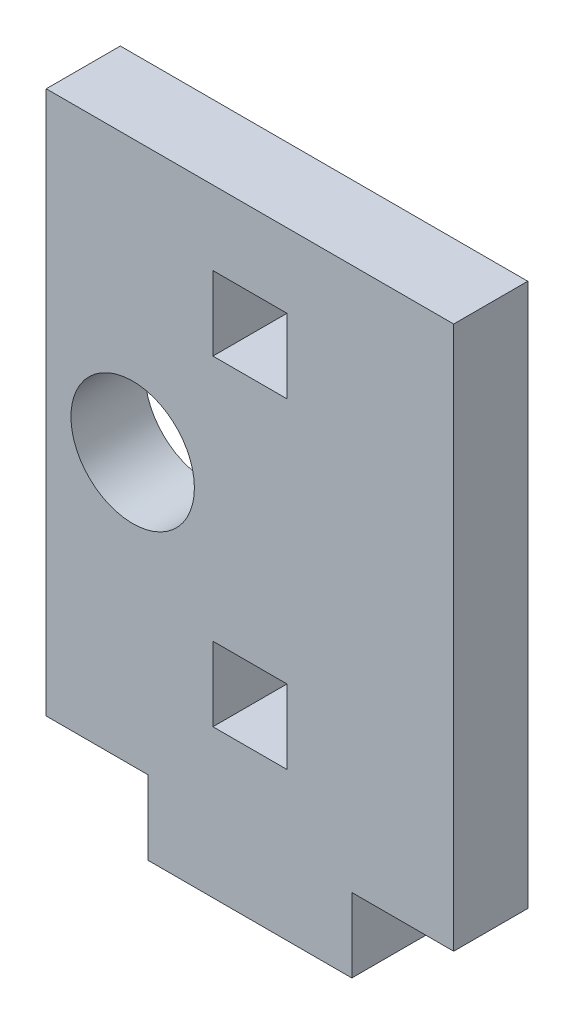
ISO-10303-21;
HEADER;
FILE_DESCRIPTION(('STEP AP214'),'2;1');
FILE_NAME('part.step','',(''),(''),'','','');
FILE_SCHEMA(('AUTOMOTIVE_DESIGN { 1 0 10303 214 1 1 1 1 }'));
ENDSEC;
DATA;
#1=APPLICATION_CONTEXT('core data for automotive mechanical design processes');
#2=APPLICATION_PROTOCOL_DEFINITION('international standard','automotive_design',2000,#1);
#3=PRODUCT_CONTEXT('',#1,'mechanical');
#4=PRODUCT('Part','Part','',(#3));
#5=PRODUCT_RELATED_PRODUCT_CATEGORY('part','',(#4));
#6=PRODUCT_DEFINITION_FORMATION('','',#4);
#7=PRODUCT_DEFINITION_CONTEXT('part definition',#1,'design');
#8=PRODUCT_DEFINITION('design','',#6,#7);
#9=PRODUCT_DEFINITION_SHAPE('','',#8);
#10=(LENGTH_UNIT() NAMED_UNIT(*) SI_UNIT(.MILLI.,.METRE.));
#11=(NAMED_UNIT(*) PLANE_ANGLE_UNIT() SI_UNIT($,.RADIAN.));
#12=(NAMED_UNIT(*) SI_UNIT($,.STERADIAN.) SOLID_ANGLE_UNIT());
#13=UNCERTAINTY_MEASURE_WITH_UNIT(LENGTH_MEASURE(1.E-05),#10,'distance_accuracy_value','');
#14=(GEOMETRIC_REPRESENTATION_CONTEXT(3) GLOBAL_UNCERTAINTY_ASSIGNED_CONTEXT((#13)) GLOBAL_UNIT_ASSIGNED_CONTEXT((#10,
#11,#12)) REPRESENTATION_CONTEXT('',''));
#15=CARTESIAN_POINT('',(0.,0.,0.));
#16=DIRECTION('',(0.,0.,1.));
#17=DIRECTION('',(1.,0.,0.));
#18=AXIS2_PLACEMENT_3D('',#15,#16,#17);
#19=CARTESIAN_POINT('',(-8.25,-11.,3.));
#20=DIRECTION('',(0.,1.,0.));
#21=DIRECTION('',(0.,0.,1.));
#22=AXIS2_PLACEMENT_3D('',#19,#20,#21);
#23=PLANE('',#22);
#24=DIRECTION('',(0.,0.,-1.));
#25=VECTOR('',#24,1.);
#26=CARTESIAN_POINT('',(-4.125,-11.,3.));
#27=LINE('',#26,#25);
#28=CARTESIAN_POINT('',(-4.125,-11.,3.));
#29=VERTEX_POINT('',#28);
#30=CARTESIAN_POINT('',(-4.125,-11.,0.));
#31=VERTEX_POINT('',#30);
#32=EDGE_CURVE('E187',#29,#31,#27,.T.);
#33=ORIENTED_EDGE('',*,*,#32,.F.);
#34=DIRECTION('',(1.,0.,0.));
#35=VECTOR('',#34,1.);
#36=CARTESIAN_POINT('',(-8.25,-11.,3.));
#37=LINE('',#36,#35);
#38=CARTESIAN_POINT('',(-8.25,-11.,3.));
#39=VERTEX_POINT('',#38);
#40=EDGE_CURVE('E257',#39,#29,#37,.T.);
#41=ORIENTED_EDGE('',*,*,#40,.F.);
#42=DIRECTION('',(0.,0.,-1.));
#43=VECTOR('',#42,1.);
#44=CARTESIAN_POINT('',(-8.25,-11.,3.));
#45=LINE('',#44,#43);
#46=CARTESIAN_POINT('',(-8.25,-11.,0.));
#47=VERTEX_POINT('',#46);
#48=EDGE_CURVE('E271',#39,#47,#45,.T.);
#49=ORIENTED_EDGE('',*,*,#48,.T.);
#50=DIRECTION('',(1.,0.,0.));
#51=VECTOR('',#50,1.);
#52=CARTESIAN_POINT('',(-8.25,-11.,0.));
#53=LINE('',#52,#51);
#54=EDGE_CURVE('E252',#47,#31,#53,.T.);
#55=ORIENTED_EDGE('',*,*,#54,.T.);
#56=EDGE_LOOP('',(#33,#41,#49,#55));
#57=FACE_BOUND('',#56,.T.);
#58=ADVANCED_FACE('F34',(#57),#23,.F.);
#59=DIRECTION('',(0.,0.,1.));
#60=VECTOR('',#59,1.);
#61=CARTESIAN_POINT('',(4.125,-11.,3.));
#62=LINE('',#61,#60);
#63=CARTESIAN_POINT('',(4.125,-11.,0.));
#64=VERTEX_POINT('',#63);
#65=CARTESIAN_POINT('',(4.125,-11.,3.));
#66=VERTEX_POINT('',#65);
#67=EDGE_CURVE('E225',#64,#66,#62,.T.);
#68=ORIENTED_EDGE('',*,*,#67,.F.);
#69=CARTESIAN_POINT('',(8.25,-11.,0.));
#70=VERTEX_POINT('',#69);
#71=EDGE_CURVE('E267',#64,#70,#53,.T.);
#72=ORIENTED_EDGE('',*,*,#71,.T.);
#73=DIRECTION('',(0.,0.,-1.));
#74=VECTOR('',#73,1.);
#75=CARTESIAN_POINT('',(8.25,-11.,3.));
#76=LINE('',#75,#74);
#77=CARTESIAN_POINT('',(8.25,-11.,3.));
#78=VERTEX_POINT('',#77);
#79=EDGE_CURVE('E260',#78,#70,#76,.T.);
#80=ORIENTED_EDGE('',*,*,#79,.F.);
#81=EDGE_CURVE('E256',#66,#78,#37,.T.);
#82=ORIENTED_EDGE('',*,*,#81,.F.);
#83=EDGE_LOOP('',(#68,#72,#80,#82));
#84=FACE_BOUND('',#83,.T.);
#85=ADVANCED_FACE('F304',(#84),#23,.F.);
#86=CARTESIAN_POINT('',(8.25,11.,3.));
#87=DIRECTION('',(-1.,0.,0.));
#88=DIRECTION('',(0.,-1.,0.));
#89=AXIS2_PLACEMENT_3D('',#86,#87,#88);
#90=PLANE('',#89);
#91=DIRECTION('',(0.,1.,0.));
#92=VECTOR('',#91,1.);
#93=CARTESIAN_POINT('',(8.25,11.,0.));
#94=LINE('',#93,#92);
#95=CARTESIAN_POINT('',(8.25,11.,0.));
#96=VERTEX_POINT('',#95);
#97=EDGE_CURVE('E247',#70,#96,#94,.T.);
#98=ORIENTED_EDGE('',*,*,#97,.T.);
#99=DIRECTION('',(0.,0.,-1.));
#100=VECTOR('',#99,1.);
#101=CARTESIAN_POINT('',(8.25,11.,3.));
#102=LINE('',#101,#100);
#103=CARTESIAN_POINT('',(8.25,11.,3.));
#104=VERTEX_POINT('',#103);
#105=EDGE_CURVE('E11',#104,#96,#102,.T.);
#106=ORIENTED_EDGE('',*,*,#105,.F.);
#107=DIRECTION('',(0.,1.,0.));
#108=VECTOR('',#107,1.);
#109=CARTESIAN_POINT('',(8.25,11.,3.));
#110=LINE('',#109,#108);
#111=EDGE_CURVE('E248',#78,#104,#110,.T.);
#112=ORIENTED_EDGE('',*,*,#111,.F.);
#113=ORIENTED_EDGE('',*,*,#79,.T.);
#114=EDGE_LOOP('',(#98,#106,#112,#113));
#115=FACE_BOUND('',#114,.T.);
#116=ADVANCED_FACE('F36',(#115),#90,.F.);
#117=CARTESIAN_POINT('',(-8.25,11.,3.));
#118=DIRECTION('',(0.,-1.,0.));
#119=DIRECTION('',(0.,0.,-1.));
#120=AXIS2_PLACEMENT_3D('',#117,#118,#119);
#121=PLANE('',#120);
#122=DIRECTION('',(-1.,0.,0.));
#123=VECTOR('',#122,1.);
#124=CARTESIAN_POINT('',(-8.25,11.,0.));
#125=LINE('',#124,#123);
#126=CARTESIAN_POINT('',(-8.25,11.,0.));
#127=VERTEX_POINT('',#126);
#128=EDGE_CURVE('E263',#96,#127,#125,.T.);
#129=ORIENTED_EDGE('',*,*,#128,.T.);
#130=DIRECTION('',(0.,0.,-1.));
#131=VECTOR('',#130,1.);
#132=CARTESIAN_POINT('',(-8.25,11.,3.));
#133=LINE('',#132,#131);
#134=CARTESIAN_POINT('',(-8.25,11.,3.));
#135=VERTEX_POINT('',#134);
#136=EDGE_CURVE('E42',#135,#127,#133,.T.);
#137=ORIENTED_EDGE('',*,*,#136,.F.);
#138=DIRECTION('',(-1.,0.,0.));
#139=VECTOR('',#138,1.);
#140=CARTESIAN_POINT('',(-8.25,11.,3.));
#141=LINE('',#140,#139);
#142=EDGE_CURVE('E251',#104,#135,#141,.T.);
#143=ORIENTED_EDGE('',*,*,#142,.F.);
#144=ORIENTED_EDGE('',*,*,#105,.T.);
#145=EDGE_LOOP('',(#129,#137,#143,#144));
#146=FACE_BOUND('',#145,.T.);
#147=ADVANCED_FACE('F308',(#146),#121,.F.);
#148=CARTESIAN_POINT('',(-8.25,11.,3.));
#149=DIRECTION('',(1.,0.,0.));
#150=DIRECTION('',(0.,1.,0.));
#151=AXIS2_PLACEMENT_3D('',#148,#149,#150);
#152=PLANE('',#151);
#153=DIRECTION('',(0.,-1.,0.));
#154=VECTOR('',#153,1.);
#155=CARTESIAN_POINT('',(-8.25,11.,0.));
#156=LINE('',#155,#154);
#157=EDGE_CURVE('E265',#127,#47,#156,.T.);
#158=ORIENTED_EDGE('',*,*,#157,.T.);
#159=ORIENTED_EDGE('',*,*,#48,.F.);
#160=DIRECTION('',(0.,-1.,0.));
#161=VECTOR('',#160,1.);
#162=CARTESIAN_POINT('',(-8.25,11.,3.));
#163=LINE('',#162,#161);
#164=EDGE_CURVE('E254',#135,#39,#163,.T.);
#165=ORIENTED_EDGE('',*,*,#164,.F.);
#166=ORIENTED_EDGE('',*,*,#136,.T.);
#167=EDGE_LOOP('',(#158,#159,#165,#166));
#168=FACE_BOUND('',#167,.T.);
#169=ADVANCED_FACE('F278',(#168),#152,.F.);
#170=CARTESIAN_POINT('',(0.,0.,3.));
#171=DIRECTION('',(0.,0.,1.));
#172=DIRECTION('',(1.,0.,0.));
#173=AXIS2_PLACEMENT_3D('',#170,#171,#172);
#174=PLANE('',#173);
#175=CARTESIAN_POINT('',(-4.75,0.,3.));
#176=DIRECTION('',(0.,0.,1.));
#177=DIRECTION('',(1.,0.,0.));
#178=AXIS2_PLACEMENT_3D('',#175,#176,#177);
#179=CIRCLE('',#178,2.5);
#180=CARTESIAN_POINT('',(-2.25,0.,3.));
#181=VERTEX_POINT('',#180);
#182=EDGE_CURVE('E174',#181,#181,#179,.T.);
#183=ORIENTED_EDGE('',*,*,#182,.F.);
#184=EDGE_LOOP('',(#183));
#185=FACE_BOUND('',#184,.T.);
#186=DIRECTION('',(0.,1.,0.));
#187=VECTOR('',#186,1.);
#188=CARTESIAN_POINT('',(1.5,8.,3.));
#189=LINE('',#188,#187);
#190=CARTESIAN_POINT('',(1.5,5.,3.));
#191=VERTEX_POINT('',#190);
#192=CARTESIAN_POINT('',(1.5,8.,3.));
#193=VERTEX_POINT('',#192);
#194=EDGE_CURVE('E49',#191,#193,#189,.T.);
#195=ORIENTED_EDGE('',*,*,#194,.F.);
#196=DIRECTION('',(1.,0.,0.));
#197=VECTOR('',#196,1.);
#198=CARTESIAN_POINT('',(-1.5,5.,3.));
#199=LINE('',#198,#197);
#200=CARTESIAN_POINT('',(-1.5,5.,3.));
#201=VERTEX_POINT('',#200);
#202=EDGE_CURVE('E168',#201,#191,#199,.T.);
#203=ORIENTED_EDGE('',*,*,#202,.F.);
#204=DIRECTION('',(0.,-1.,0.));
#205=VECTOR('',#204,1.);
#206=CARTESIAN_POINT('',(-1.5,8.,3.));
#207=LINE('',#206,#205);
#208=CARTESIAN_POINT('',(-1.5,8.,3.));
#209=VERTEX_POINT('',#208);
#210=EDGE_CURVE('E171',#209,#201,#207,.T.);
#211=ORIENTED_EDGE('',*,*,#210,.F.);
#212=DIRECTION('',(-1.,0.,0.));
#213=VECTOR('',#212,1.);
#214=CARTESIAN_POINT('',(-1.5,8.,3.));
#215=LINE('',#214,#213);
#216=EDGE_CURVE('E180',#193,#209,#215,.T.);
#217=ORIENTED_EDGE('',*,*,#216,.F.);
#218=EDGE_LOOP('',(#195,#203,#211,#217));
#219=FACE_BOUND('',#218,.T.);
#220=DIRECTION('',(0.,1.,0.));
#221=VECTOR('',#220,1.);
#222=CARTESIAN_POINT('',(1.5,-5.,3.));
#223=LINE('',#222,#221);
#224=CARTESIAN_POINT('',(1.5,-8.,3.));
#225=VERTEX_POINT('',#224);
#226=CARTESIAN_POINT('',(1.5,-5.,3.));
#227=VERTEX_POINT('',#226);
#228=EDGE_CURVE('E57',#225,#227,#223,.T.);
#229=ORIENTED_EDGE('',*,*,#228,.F.);
#230=DIRECTION('',(1.,0.,0.));
#231=VECTOR('',#230,1.);
#232=CARTESIAN_POINT('',(-1.5,-8.,3.));
#233=LINE('',#232,#231);
#234=CARTESIAN_POINT('',(-1.5,-8.,3.));
#235=VERTEX_POINT('',#234);
#236=EDGE_CURVE('E195',#235,#225,#233,.T.);
#237=ORIENTED_EDGE('',*,*,#236,.F.);
#238=DIRECTION('',(0.,-1.,0.));
#239=VECTOR('',#238,1.);
#240=CARTESIAN_POINT('',(-1.5,-5.,3.));
#241=LINE('',#240,#239);
#242=CARTESIAN_POINT('',(-1.5,-5.,3.));
#243=VERTEX_POINT('',#242);
#244=EDGE_CURVE('E210',#243,#235,#241,.T.);
#245=ORIENTED_EDGE('',*,*,#244,.F.);
#246=DIRECTION('',(-1.,0.,0.));
#247=VECTOR('',#246,1.);
#248=CARTESIAN_POINT('',(-1.5,-5.,3.));
#249=LINE('',#248,#247);
#250=EDGE_CURVE('E206',#227,#243,#249,.T.);
#251=ORIENTED_EDGE('',*,*,#250,.F.);
#252=EDGE_LOOP('',(#229,#237,#245,#251));
#253=FACE_BOUND('',#252,.T.);
#254=ORIENTED_EDGE('',*,*,#111,.T.);
#255=ORIENTED_EDGE('',*,*,#142,.T.);
#256=ORIENTED_EDGE('',*,*,#164,.T.);
#257=ORIENTED_EDGE('',*,*,#40,.T.);
#258=DIRECTION('',(0.,1.,0.));
#259=VECTOR('',#258,1.);
#260=CARTESIAN_POINT('',(-4.125,-14.,3.));
#261=LINE('',#260,#259);
#262=CARTESIAN_POINT('',(-4.125,-14.,3.));
#263=VERTEX_POINT('',#262);
#264=EDGE_CURVE('E231',#263,#29,#261,.T.);
#265=ORIENTED_EDGE('',*,*,#264,.F.);
#266=DIRECTION('',(-1.,0.,0.));
#267=VECTOR('',#266,1.);
#268=CARTESIAN_POINT('',(-4.125,-14.,3.));
#269=LINE('',#268,#267);
#270=CARTESIAN_POINT('',(4.125,-14.,3.));
#271=VERTEX_POINT('',#270);
#272=EDGE_CURVE('E229',#271,#263,#269,.T.);
#273=ORIENTED_EDGE('',*,*,#272,.F.);
#274=DIRECTION('',(0.,1.,0.));
#275=VECTOR('',#274,1.);
#276=CARTESIAN_POINT('',(4.125,-14.,3.));
#277=LINE('',#276,#275);
#278=EDGE_CURVE('E238',#271,#66,#277,.T.);
#279=ORIENTED_EDGE('',*,*,#278,.T.);
#280=ORIENTED_EDGE('',*,*,#81,.T.);
#281=EDGE_LOOP('',(#254,#255,#256,#257,#265,#273,#279,#280));
#282=FACE_BOUND('',#281,.T.);
#283=ADVANCED_FACE('F289',(#185,#219,#253,#282),#174,.T.);
#284=CARTESIAN_POINT('',(0.,0.,0.));
#285=DIRECTION('',(0.,0.,1.));
#286=DIRECTION('',(1.,0.,0.));
#287=AXIS2_PLACEMENT_3D('',#284,#285,#286);
#288=PLANE('',#287);
#289=CARTESIAN_POINT('',(-4.75,0.,0.));
#290=DIRECTION('',(0.,0.,1.));
#291=DIRECTION('',(1.,0.,0.));
#292=AXIS2_PLACEMENT_3D('',#289,#290,#291);
#293=CIRCLE('',#292,2.5);
#294=CARTESIAN_POINT('',(-2.25,0.,0.));
#295=VERTEX_POINT('',#294);
#296=EDGE_CURVE('E207',#295,#295,#293,.T.);
#297=ORIENTED_EDGE('',*,*,#296,.T.);
#298=EDGE_LOOP('',(#297));
#299=FACE_BOUND('',#298,.T.);
#300=DIRECTION('',(1.,0.,0.));
#301=VECTOR('',#300,1.);
#302=CARTESIAN_POINT('',(-1.5,5.,0.));
#303=LINE('',#302,#301);
#304=CARTESIAN_POINT('',(-1.5,5.,0.));
#305=VERTEX_POINT('',#304);
#306=CARTESIAN_POINT('',(1.5,5.,0.));
#307=VERTEX_POINT('',#306);
#308=EDGE_CURVE('E155',#305,#307,#303,.T.);
#309=ORIENTED_EDGE('',*,*,#308,.T.);
#310=DIRECTION('',(0.,1.,0.));
#311=VECTOR('',#310,1.);
#312=CARTESIAN_POINT('',(1.5,8.,0.));
#313=LINE('',#312,#311);
#314=CARTESIAN_POINT('',(1.5,8.,0.));
#315=VERTEX_POINT('',#314);
#316=EDGE_CURVE('E149',#307,#315,#313,.T.);
#317=ORIENTED_EDGE('',*,*,#316,.T.);
#318=DIRECTION('',(-1.,0.,0.));
#319=VECTOR('',#318,1.);
#320=CARTESIAN_POINT('',(-1.5,8.,0.));
#321=LINE('',#320,#319);
#322=CARTESIAN_POINT('',(-1.5,8.,0.));
#323=VERTEX_POINT('',#322);
#324=EDGE_CURVE('E159',#315,#323,#321,.T.);
#325=ORIENTED_EDGE('',*,*,#324,.T.);
#326=DIRECTION('',(0.,-1.,0.));
#327=VECTOR('',#326,1.);
#328=CARTESIAN_POINT('',(-1.5,8.,0.));
#329=LINE('',#328,#327);
#330=EDGE_CURVE('E163',#323,#305,#329,.T.);
#331=ORIENTED_EDGE('',*,*,#330,.T.);
#332=EDGE_LOOP('',(#309,#317,#325,#331));
#333=FACE_BOUND('',#332,.T.);
#334=DIRECTION('',(1.,0.,0.));
#335=VECTOR('',#334,1.);
#336=CARTESIAN_POINT('',(-1.5,-8.,0.));
#337=LINE('',#336,#335);
#338=CARTESIAN_POINT('',(-1.5,-8.,0.));
#339=VERTEX_POINT('',#338);
#340=CARTESIAN_POINT('',(1.5,-8.,0.));
#341=VERTEX_POINT('',#340);
#342=EDGE_CURVE('E201',#339,#341,#337,.T.);
#343=ORIENTED_EDGE('',*,*,#342,.T.);
#344=DIRECTION('',(0.,1.,0.));
#345=VECTOR('',#344,1.);
#346=CARTESIAN_POINT('',(1.5,-5.,0.));
#347=LINE('',#346,#345);
#348=CARTESIAN_POINT('',(1.5,-5.,0.));
#349=VERTEX_POINT('',#348);
#350=EDGE_CURVE('E191',#341,#349,#347,.T.);
#351=ORIENTED_EDGE('',*,*,#350,.T.);
#352=DIRECTION('',(-1.,0.,0.));
#353=VECTOR('',#352,1.);
#354=CARTESIAN_POINT('',(-1.5,-5.,0.));
#355=LINE('',#354,#353);
#356=CARTESIAN_POINT('',(-1.5,-5.,0.));
#357=VERTEX_POINT('',#356);
#358=EDGE_CURVE('E194',#349,#357,#355,.T.);
#359=ORIENTED_EDGE('',*,*,#358,.T.);
#360=DIRECTION('',(0.,-1.,0.));
#361=VECTOR('',#360,1.);
#362=CARTESIAN_POINT('',(-1.5,-5.,0.));
#363=LINE('',#362,#361);
#364=EDGE_CURVE('E198',#357,#339,#363,.T.);
#365=ORIENTED_EDGE('',*,*,#364,.T.);
#366=EDGE_LOOP('',(#343,#351,#359,#365));
#367=FACE_BOUND('',#366,.T.);
#368=ORIENTED_EDGE('',*,*,#97,.F.);
#369=ORIENTED_EDGE('',*,*,#71,.F.);
#370=DIRECTION('',(0.,1.,0.));
#371=VECTOR('',#370,1.);
#372=CARTESIAN_POINT('',(4.125,-14.,0.));
#373=LINE('',#372,#371);
#374=CARTESIAN_POINT('',(4.125,-14.,0.));
#375=VERTEX_POINT('',#374);
#376=EDGE_CURVE('E241',#375,#64,#373,.T.);
#377=ORIENTED_EDGE('',*,*,#376,.F.);
#378=DIRECTION('',(1.,0.,0.));
#379=VECTOR('',#378,1.);
#380=CARTESIAN_POINT('',(-4.125,-14.,0.));
#381=LINE('',#380,#379);
#382=CARTESIAN_POINT('',(-4.125,-14.,0.));
#383=VERTEX_POINT('',#382);
#384=EDGE_CURVE('E224',#383,#375,#381,.T.);
#385=ORIENTED_EDGE('',*,*,#384,.F.);
#386=DIRECTION('',(0.,1.,0.));
#387=VECTOR('',#386,1.);
#388=CARTESIAN_POINT('',(-4.125,-14.,0.));
#389=LINE('',#388,#387);
#390=EDGE_CURVE('E244',#383,#31,#389,.T.);
#391=ORIENTED_EDGE('',*,*,#390,.T.);
#392=ORIENTED_EDGE('',*,*,#54,.F.);
#393=ORIENTED_EDGE('',*,*,#157,.F.);
#394=ORIENTED_EDGE('',*,*,#128,.F.);
#395=EDGE_LOOP('',(#368,#369,#377,#385,#391,#392,#393,#394));
#396=FACE_BOUND('',#395,.T.);
#397=ADVANCED_FACE('F165',(#299,#333,#367,#396),#288,.F.);
#398=CARTESIAN_POINT('',(-4.125,-14.,3.));
#399=DIRECTION('',(1.,0.,0.));
#400=DIRECTION('',(0.,0.,-1.));
#401=AXIS2_PLACEMENT_3D('',#398,#399,#400);
#402=PLANE('',#401);
#403=ORIENTED_EDGE('',*,*,#32,.T.);
#404=ORIENTED_EDGE('',*,*,#390,.F.);
#405=DIRECTION('',(0.,0.,-1.));
#406=VECTOR('',#405,1.);
#407=CARTESIAN_POINT('',(-4.125,-14.,3.));
#408=LINE('',#407,#406);
#409=EDGE_CURVE('E221',#263,#383,#408,.T.);
#410=ORIENTED_EDGE('',*,*,#409,.F.);
#411=ORIENTED_EDGE('',*,*,#264,.T.);
#412=EDGE_LOOP('',(#403,#404,#410,#411));
#413=FACE_BOUND('',#412,.T.);
#414=ADVANCED_FACE('F293',(#413),#402,.F.);
#415=CARTESIAN_POINT('',(4.125,-14.,3.));
#416=DIRECTION('',(-1.,0.,0.));
#417=DIRECTION('',(0.,0.,1.));
#418=AXIS2_PLACEMENT_3D('',#415,#416,#417);
#419=PLANE('',#418);
#420=ORIENTED_EDGE('',*,*,#67,.T.);
#421=ORIENTED_EDGE('',*,*,#278,.F.);
#422=DIRECTION('',(0.,0.,1.));
#423=VECTOR('',#422,1.);
#424=CARTESIAN_POINT('',(4.125,-14.,3.));
#425=LINE('',#424,#423);
#426=EDGE_CURVE('E227',#375,#271,#425,.T.);
#427=ORIENTED_EDGE('',*,*,#426,.F.);
#428=ORIENTED_EDGE('',*,*,#376,.T.);
#429=EDGE_LOOP('',(#420,#421,#427,#428));
#430=FACE_BOUND('',#429,.T.);
#431=ADVANCED_FACE('F301',(#430),#419,.F.);
#432=CARTESIAN_POINT('',(0.,-14.,0.));
#433=DIRECTION('',(0.,-1.,0.));
#434=DIRECTION('',(0.,0.,-1.));
#435=AXIS2_PLACEMENT_3D('',#432,#433,#434);
#436=PLANE('',#435);
#437=ORIENTED_EDGE('',*,*,#409,.T.);
#438=ORIENTED_EDGE('',*,*,#384,.T.);
#439=ORIENTED_EDGE('',*,*,#426,.T.);
#440=ORIENTED_EDGE('',*,*,#272,.T.);
#441=EDGE_LOOP('',(#437,#438,#439,#440));
#442=FACE_BOUND('',#441,.T.);
#443=ADVANCED_FACE('F295',(#442),#436,.T.);
#444=CARTESIAN_POINT('',(1.5,-5.,0.));
#445=DIRECTION('',(1.,0.,0.));
#446=DIRECTION('',(0.,1.,0.));
#447=AXIS2_PLACEMENT_3D('',#444,#445,#446);
#448=PLANE('',#447);
#449=ORIENTED_EDGE('',*,*,#228,.T.);
#450=DIRECTION('',(0.,0.,1.));
#451=VECTOR('',#450,1.);
#452=CARTESIAN_POINT('',(1.5,-5.,0.));
#453=LINE('',#452,#451);
#454=EDGE_CURVE('E204',#349,#227,#453,.T.);
#455=ORIENTED_EDGE('',*,*,#454,.F.);
#456=ORIENTED_EDGE('',*,*,#350,.F.);
#457=DIRECTION('',(0.,0.,1.));
#458=VECTOR('',#457,1.);
#459=CARTESIAN_POINT('',(1.5,-8.,0.));
#460=LINE('',#459,#458);
#461=EDGE_CURVE('E181',#341,#225,#460,.T.);
#462=ORIENTED_EDGE('',*,*,#461,.T.);
#463=EDGE_LOOP('',(#449,#455,#456,#462));
#464=FACE_BOUND('',#463,.T.);
#465=ADVANCED_FACE('F333',(#464),#448,.F.);
#466=CARTESIAN_POINT('',(-1.5,-8.,0.));
#467=DIRECTION('',(0.,-1.,0.));
#468=DIRECTION('',(0.,0.,-1.));
#469=AXIS2_PLACEMENT_3D('',#466,#467,#468);
#470=PLANE('',#469);
#471=ORIENTED_EDGE('',*,*,#236,.T.);
#472=ORIENTED_EDGE('',*,*,#461,.F.);
#473=ORIENTED_EDGE('',*,*,#342,.F.);
#474=DIRECTION('',(0.,0.,1.));
#475=VECTOR('',#474,1.);
#476=CARTESIAN_POINT('',(-1.5,-8.,0.));
#477=LINE('',#476,#475);
#478=EDGE_CURVE('E216',#339,#235,#477,.T.);
#479=ORIENTED_EDGE('',*,*,#478,.T.);
#480=EDGE_LOOP('',(#471,#472,#473,#479));
#481=FACE_BOUND('',#480,.T.);
#482=ADVANCED_FACE('F336',(#481),#470,.F.);
#483=CARTESIAN_POINT('',(-1.5,-5.,0.));
#484=DIRECTION('',(-1.,0.,0.));
#485=DIRECTION('',(0.,-1.,0.));
#486=AXIS2_PLACEMENT_3D('',#483,#484,#485);
#487=PLANE('',#486);
#488=ORIENTED_EDGE('',*,*,#244,.T.);
#489=ORIENTED_EDGE('',*,*,#478,.F.);
#490=ORIENTED_EDGE('',*,*,#364,.F.);
#491=DIRECTION('',(0.,0.,1.));
#492=VECTOR('',#491,1.);
#493=CARTESIAN_POINT('',(-1.5,-5.,0.));
#494=LINE('',#493,#492);
#495=EDGE_CURVE('E218',#357,#243,#494,.T.);
#496=ORIENTED_EDGE('',*,*,#495,.T.);
#497=EDGE_LOOP('',(#488,#489,#490,#496));
#498=FACE_BOUND('',#497,.T.);
#499=ADVANCED_FACE('F340',(#498),#487,.F.);
#500=CARTESIAN_POINT('',(-1.5,-5.,0.));
#501=DIRECTION('',(0.,1.,0.));
#502=DIRECTION('',(0.,0.,1.));
#503=AXIS2_PLACEMENT_3D('',#500,#501,#502);
#504=PLANE('',#503);
#505=ORIENTED_EDGE('',*,*,#250,.T.);
#506=ORIENTED_EDGE('',*,*,#495,.F.);
#507=ORIENTED_EDGE('',*,*,#358,.F.);
#508=ORIENTED_EDGE('',*,*,#454,.T.);
#509=EDGE_LOOP('',(#505,#506,#507,#508));
#510=FACE_BOUND('',#509,.T.);
#511=ADVANCED_FACE('F337',(#510),#504,.F.);
#512=CARTESIAN_POINT('',(1.5,8.,0.));
#513=DIRECTION('',(1.,0.,0.));
#514=DIRECTION('',(0.,1.,0.));
#515=AXIS2_PLACEMENT_3D('',#512,#513,#514);
#516=PLANE('',#515);
#517=ORIENTED_EDGE('',*,*,#194,.T.);
#518=DIRECTION('',(0.,0.,1.));
#519=VECTOR('',#518,1.);
#520=CARTESIAN_POINT('',(1.5,8.,0.));
#521=LINE('',#520,#519);
#522=EDGE_CURVE('E145',#315,#193,#521,.T.);
#523=ORIENTED_EDGE('',*,*,#522,.F.);
#524=ORIENTED_EDGE('',*,*,#316,.F.);
#525=DIRECTION('',(0.,0.,1.));
#526=VECTOR('',#525,1.);
#527=CARTESIAN_POINT('',(1.5,5.,0.));
#528=LINE('',#527,#526);
#529=EDGE_CURVE('E185',#307,#191,#528,.T.);
#530=ORIENTED_EDGE('',*,*,#529,.T.);
#531=EDGE_LOOP('',(#517,#523,#524,#530));
#532=FACE_BOUND('',#531,.T.);
#533=ADVANCED_FACE('F147',(#532),#516,.F.);
#534=CARTESIAN_POINT('',(-1.5,5.,0.));
#535=DIRECTION('',(0.,-1.,0.));
#536=DIRECTION('',(1.,0.,0.));
#537=AXIS2_PLACEMENT_3D('',#534,#535,#536);
#538=PLANE('',#537);
#539=ORIENTED_EDGE('',*,*,#202,.T.);
#540=ORIENTED_EDGE('',*,*,#529,.F.);
#541=ORIENTED_EDGE('',*,*,#308,.F.);
#542=DIRECTION('',(0.,0.,1.));
#543=VECTOR('',#542,1.);
#544=CARTESIAN_POINT('',(-1.5,5.,0.));
#545=LINE('',#544,#543);
#546=EDGE_CURVE('E188',#305,#201,#545,.T.);
#547=ORIENTED_EDGE('',*,*,#546,.T.);
#548=EDGE_LOOP('',(#539,#540,#541,#547));
#549=FACE_BOUND('',#548,.T.);
#550=ADVANCED_FACE('F350',(#549),#538,.F.);
#551=CARTESIAN_POINT('',(-1.5,8.,0.));
#552=DIRECTION('',(-1.,0.,0.));
#553=DIRECTION('',(0.,-1.,0.));
#554=AXIS2_PLACEMENT_3D('',#551,#552,#553);
#555=PLANE('',#554);
#556=ORIENTED_EDGE('',*,*,#210,.T.);
#557=ORIENTED_EDGE('',*,*,#546,.F.);
#558=ORIENTED_EDGE('',*,*,#330,.F.);
#559=DIRECTION('',(0.,0.,1.));
#560=VECTOR('',#559,1.);
#561=CARTESIAN_POINT('',(-1.5,8.,0.));
#562=LINE('',#561,#560);
#563=EDGE_CURVE('E154',#323,#209,#562,.T.);
#564=ORIENTED_EDGE('',*,*,#563,.T.);
#565=EDGE_LOOP('',(#556,#557,#558,#564));
#566=FACE_BOUND('',#565,.T.);
#567=ADVANCED_FACE('F354',(#566),#555,.F.);
#568=CARTESIAN_POINT('',(-1.5,8.,0.));
#569=DIRECTION('',(0.,1.,0.));
#570=DIRECTION('',(-1.,0.,0.));
#571=AXIS2_PLACEMENT_3D('',#568,#569,#570);
#572=PLANE('',#571);
#573=ORIENTED_EDGE('',*,*,#216,.T.);
#574=ORIENTED_EDGE('',*,*,#563,.F.);
#575=ORIENTED_EDGE('',*,*,#324,.F.);
#576=ORIENTED_EDGE('',*,*,#522,.T.);
#577=EDGE_LOOP('',(#573,#574,#575,#576));
#578=FACE_BOUND('',#577,.T.);
#579=ADVANCED_FACE('F160',(#578),#572,.F.);
#580=CARTESIAN_POINT('',(-4.75,0.,0.));
#581=DIRECTION('',(0.,0.,1.));
#582=DIRECTION('',(1.,0.,0.));
#583=AXIS2_PLACEMENT_3D('',#580,#581,#582);
#584=CYLINDRICAL_SURFACE('',#583,2.5);
#585=ORIENTED_EDGE('',*,*,#296,.F.);
#586=EDGE_LOOP('',(#585));
#587=FACE_BOUND('',#586,.T.);
#588=ORIENTED_EDGE('',*,*,#182,.T.);
#589=EDGE_LOOP('',(#588));
#590=FACE_BOUND('',#589,.T.);
#591=ADVANCED_FACE('F353',(#587,#590),#584,.F.);
#592=CLOSED_SHELL('',(#58,#85,#116,#147,#169,#283,#397,#414,#431,#443,#465,#482,#499,#511,#533,
#550,#567,#579,#591));
#593=MANIFOLD_SOLID_BREP('B2',#592);
#594=ADVANCED_BREP_SHAPE_REPRESENTATION('',(#18,#593),#14);
#595=SHAPE_DEFINITION_REPRESENTATION(#9,#594);
ENDSEC;
END-ISO-10303-21;
